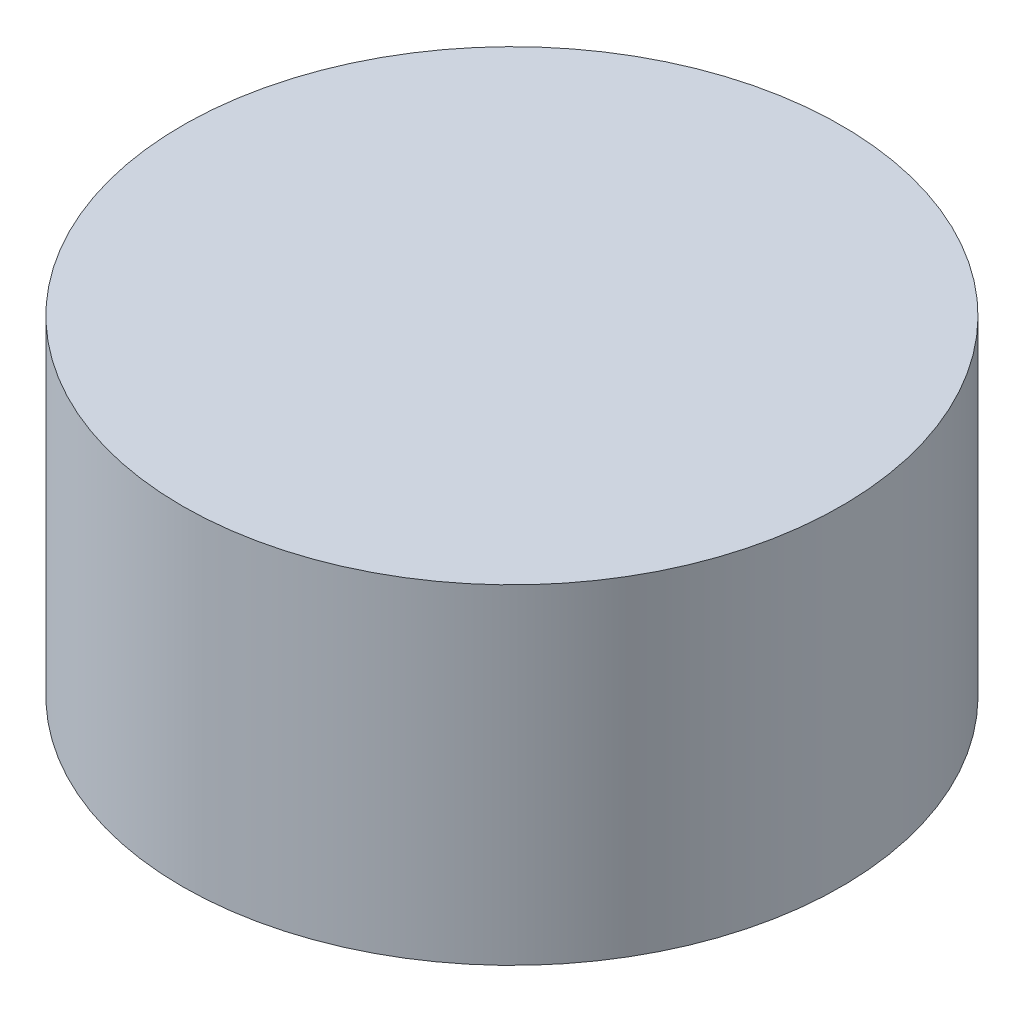
ISO-10303-21;
HEADER;
FILE_DESCRIPTION(('STEP AP214'),'2;1');
FILE_NAME('part.step','',(''),(''),'','','');
FILE_SCHEMA(('AUTOMOTIVE_DESIGN { 1 0 10303 214 1 1 1 1 }'));
ENDSEC;
DATA;
#1=APPLICATION_CONTEXT('core data for automotive mechanical design processes');
#2=APPLICATION_PROTOCOL_DEFINITION('international standard','automotive_design',2000,#1);
#3=PRODUCT_CONTEXT('',#1,'mechanical');
#4=PRODUCT('Part','Part','',(#3));
#5=PRODUCT_RELATED_PRODUCT_CATEGORY('part','',(#4));
#6=PRODUCT_DEFINITION_FORMATION('','',#4);
#7=PRODUCT_DEFINITION_CONTEXT('part definition',#1,'design');
#8=PRODUCT_DEFINITION('design','',#6,#7);
#9=PRODUCT_DEFINITION_SHAPE('','',#8);
#10=(LENGTH_UNIT() NAMED_UNIT(*) SI_UNIT(.MILLI.,.METRE.));
#11=(NAMED_UNIT(*) PLANE_ANGLE_UNIT() SI_UNIT($,.RADIAN.));
#12=(NAMED_UNIT(*) SI_UNIT($,.STERADIAN.) SOLID_ANGLE_UNIT());
#13=UNCERTAINTY_MEASURE_WITH_UNIT(LENGTH_MEASURE(1.E-05),#10,'distance_accuracy_value','');
#14=(GEOMETRIC_REPRESENTATION_CONTEXT(3) GLOBAL_UNCERTAINTY_ASSIGNED_CONTEXT((#13)) GLOBAL_UNIT_ASSIGNED_CONTEXT((#10,
#11,#12)) REPRESENTATION_CONTEXT('',''));
#15=CARTESIAN_POINT('',(0.,0.,0.));
#16=DIRECTION('',(0.,0.,1.));
#17=DIRECTION('',(1.,0.,0.));
#18=AXIS2_PLACEMENT_3D('',#15,#16,#17);
#19=CARTESIAN_POINT('',(0.,3.,0.));
#20=DIRECTION('',(0.,-1.,0.));
#21=DIRECTION('',(0.,0.,-1.));
#22=AXIS2_PLACEMENT_3D('',#19,#20,#21);
#23=CYLINDRICAL_SURFACE('',#22,3.);
#24=CARTESIAN_POINT('',(0.,3.,0.));
#25=DIRECTION('',(0.,1.,0.));
#26=DIRECTION('',(0.,0.,1.));
#27=AXIS2_PLACEMENT_3D('',#24,#25,#26);
#28=CIRCLE('',#27,3.);
#29=CARTESIAN_POINT('',(0.,3.,3.));
#30=VERTEX_POINT('',#29);
#31=EDGE_CURVE('E10',#30,#30,#28,.T.);
#32=ORIENTED_EDGE('',*,*,#31,.F.);
#33=EDGE_LOOP('',(#32));
#34=FACE_BOUND('',#33,.T.);
#35=CARTESIAN_POINT('',(0.,0.,0.));
#36=DIRECTION('',(0.,1.,0.));
#37=DIRECTION('',(0.,0.,1.));
#38=AXIS2_PLACEMENT_3D('',#35,#36,#37);
#39=CIRCLE('',#38,3.);
#40=CARTESIAN_POINT('',(0.,0.,3.));
#41=VERTEX_POINT('',#40);
#42=EDGE_CURVE('E36',#41,#41,#39,.T.);
#43=ORIENTED_EDGE('',*,*,#42,.T.);
#44=EDGE_LOOP('',(#43));
#45=FACE_BOUND('',#44,.T.);
#46=ADVANCED_FACE('F33',(#34,#45),#23,.T.);
#47=CARTESIAN_POINT('',(0.,3.,0.));
#48=DIRECTION('',(0.,1.,0.));
#49=DIRECTION('',(0.,0.,1.));
#50=AXIS2_PLACEMENT_3D('',#47,#48,#49);
#51=PLANE('',#50);
#52=ORIENTED_EDGE('',*,*,#31,.T.);
#53=EDGE_LOOP('',(#52));
#54=FACE_BOUND('',#53,.T.);
#55=ADVANCED_FACE('F48',(#54),#51,.T.);
#56=CARTESIAN_POINT('',(0.,0.,0.));
#57=DIRECTION('',(0.,1.,0.));
#58=DIRECTION('',(0.,0.,1.));
#59=AXIS2_PLACEMENT_3D('',#56,#57,#58);
#60=PLANE('',#59);
#61=ORIENTED_EDGE('',*,*,#42,.F.);
#62=EDGE_LOOP('',(#61));
#63=FACE_BOUND('',#62,.T.);
#64=ADVANCED_FACE('F46',(#63),#60,.F.);
#65=CLOSED_SHELL('',(#46,#55,#64));
#66=MANIFOLD_SOLID_BREP('B2',#65);
#67=ADVANCED_BREP_SHAPE_REPRESENTATION('',(#18,#66),#14);
#68=SHAPE_DEFINITION_REPRESENTATION(#9,#67);
ENDSEC;
END-ISO-10303-21;
